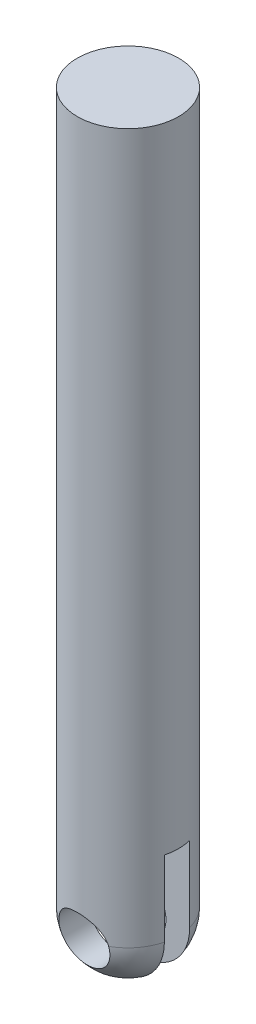
ISO-10303-21;
HEADER;
FILE_DESCRIPTION(('STEP AP214'),'2;1');
FILE_NAME('part.step','',(''),(''),'','','');
FILE_SCHEMA(('AUTOMOTIVE_DESIGN { 1 0 10303 214 1 1 1 1 }'));
ENDSEC;
DATA;
#1=APPLICATION_CONTEXT('core data for automotive mechanical design processes');
#2=APPLICATION_PROTOCOL_DEFINITION('international standard','automotive_design',2000,#1);
#3=PRODUCT_CONTEXT('',#1,'mechanical');
#4=PRODUCT('Part','Part','',(#3));
#5=PRODUCT_RELATED_PRODUCT_CATEGORY('part','',(#4));
#6=PRODUCT_DEFINITION_FORMATION('','',#4);
#7=PRODUCT_DEFINITION_CONTEXT('part definition',#1,'design');
#8=PRODUCT_DEFINITION('design','',#6,#7);
#9=PRODUCT_DEFINITION_SHAPE('','',#8);
#10=(LENGTH_UNIT() NAMED_UNIT(*) SI_UNIT(.MILLI.,.METRE.));
#11=(NAMED_UNIT(*) PLANE_ANGLE_UNIT() SI_UNIT($,.RADIAN.));
#12=(NAMED_UNIT(*) SI_UNIT($,.STERADIAN.) SOLID_ANGLE_UNIT());
#13=UNCERTAINTY_MEASURE_WITH_UNIT(LENGTH_MEASURE(1.E-05),#10,'distance_accuracy_value','');
#14=(GEOMETRIC_REPRESENTATION_CONTEXT(3) GLOBAL_UNCERTAINTY_ASSIGNED_CONTEXT((#13)) GLOBAL_UNIT_ASSIGNED_CONTEXT((#10,
#11,#12)) REPRESENTATION_CONTEXT('',''));
#15=CARTESIAN_POINT('',(0.,0.,0.));
#16=DIRECTION('',(0.,0.,1.));
#17=DIRECTION('',(1.,0.,0.));
#18=AXIS2_PLACEMENT_3D('',#15,#16,#17);
#19=CARTESIAN_POINT('',(0.,93.5,2.5));
#20=DIRECTION('',(0.,1.,0.));
#21=DIRECTION('',(1.,0.,0.));
#22=AXIS2_PLACEMENT_3D('',#19,#20,#21);
#23=SPHERICAL_SURFACE('',#22,10.);
#24=CARTESIAN_POINT('',(0.,93.5,2.5));
#25=DIRECTION('',(0.,1.,0.));
#26=DIRECTION('',(-1.,0.,0.));
#27=AXIS2_PLACEMENT_3D('',#24,#25,#26);
#28=CIRCLE('',#27,10.);
#29=CARTESIAN_POINT('',(4.89897948556635,93.5,11.2177978870813));
#30=VERTEX_POINT('',#29);
#31=CARTESIAN_POINT('',(9.68245836551854,93.5,5.));
#32=VERTEX_POINT('',#31);
#33=EDGE_CURVE('E111',#30,#32,#28,.T.);
#34=ORIENTED_EDGE('',*,*,#33,.F.);
#35=CARTESIAN_POINT('',(4.89893865648469,93.5002,11.2178208286245));
#36=CARTESIAN_POINT('',(4.92727418921963,93.3614873870076,11.2019098802133));
#37=CARTESIAN_POINT('',(4.94968515353325,93.2215887869732,11.1858184751447));
#38=CARTESIAN_POINT('',(4.98257086903547,92.9404311381345,11.1533879579725));
#39=CARTESIAN_POINT('',(4.99304624353029,92.799172160761,11.1370488588494));
#40=CARTESIAN_POINT('',(5.0019738665503,92.5163797265705,11.1042448150247));
#41=CARTESIAN_POINT('',(5.00043368842381,92.3748464988518,11.0877799561266));
#42=CARTESIAN_POINT('',(4.98536616484066,92.0924234657632,11.0548301095291));
#43=CARTESIAN_POINT('',(4.97183893845378,91.951533654016,11.0383451220313));
#44=CARTESIAN_POINT('',(4.93288594095179,91.6713588465171,11.0054681250731));
#45=CARTESIAN_POINT('',(4.90745701402313,91.5320742864509,10.9890761414407));
#46=CARTESIAN_POINT('',(4.84486426425658,91.256087182425,10.9565028063938));
#47=CARTESIAN_POINT('',(4.80769610914868,91.1193856114675,10.9403215350402));
#48=CARTESIAN_POINT('',(4.7219086944933,90.8496686132408,10.9083050231958));
#49=CARTESIAN_POINT('',(4.67329593200435,90.7166511422317,10.8924695919263));
#50=CARTESIAN_POINT('',(4.56492326752218,90.455123939594,10.8612494080196));
#51=CARTESIAN_POINT('',(4.50515926596108,90.3266158864868,10.8458648235431));
#52=CARTESIAN_POINT('',(4.37497965213287,90.0752178683008,10.8156877757602));
#53=CARTESIAN_POINT('',(4.3045755866293,89.9523219987986,10.8008946922911));
#54=CARTESIAN_POINT('',(4.1535285386618,89.7128420516729,10.7719945007179));
#55=CARTESIAN_POINT('',(4.07288177337091,89.5962603287924,10.757887648728));
#56=CARTESIAN_POINT('',(3.90195221061515,89.3703307733303,10.7304829323995));
#57=CARTESIAN_POINT('',(3.81167169322654,89.2609812389448,10.7171848778025));
#58=CARTESIAN_POINT('',(3.62205669025078,89.05024590475,10.6914990601853));
#59=CARTESIAN_POINT('',(3.52271888930685,88.9488630465753,10.6791116335154));
#60=CARTESIAN_POINT('',(3.3162831566464,88.7553812276067,10.6554216350037));
#61=CARTESIAN_POINT('',(3.2092303992527,88.6632347446997,10.6441135260503));
#62=CARTESIAN_POINT('',(2.98760357675197,88.4882463710375,10.6225986329848));
#63=CARTESIAN_POINT('',(2.8730267477674,88.405407930117,10.6123922572621));
#64=CARTESIAN_POINT('',(2.63725372669888,88.249724839181,10.5931787316651));
#65=CARTESIAN_POINT('',(2.5160606199192,88.17687558573,10.5841710294487));
#66=CARTESIAN_POINT('',(2.26782923052538,88.0416440206182,10.567425746954));
#67=CARTESIAN_POINT('',(2.14078881888704,87.979265560444,10.559688634061));
#68=CARTESIAN_POINT('',(1.88278611087447,87.8659080562942,10.5456115639289));
#69=CARTESIAN_POINT('',(1.75186082723434,87.8148462145952,10.5392614639566));
#70=CARTESIAN_POINT('',(1.48611564854605,87.7238902138853,10.5279394657527));
#71=CARTESIAN_POINT('',(1.35129434101507,87.6840001626356,10.5229680744658));
#72=CARTESIAN_POINT('',(0.942516399613429,87.5816316505213,10.5102021912795));
#73=CARTESIAN_POINT('',(0.6639590033556,87.5363290797153,10.5045403355134));
#74=CARTESIAN_POINT('',(0.10498784504106,87.4932786771967,10.4991602063714));
#75=CARTESIAN_POINT('',(-0.17540524566824,87.495251646546,10.4994070375818));
#76=CARTESIAN_POINT('',(-0.732041754387001,87.5460064676561,10.5057493957929));
#77=CARTESIAN_POINT('',(-1.00828524491241,87.5947875004583,10.5118448204661));
#78=CARTESIAN_POINT('',(-1.41305667331737,87.7017892741581,10.5251851478467));
#79=CARTESIAN_POINT('',(-1.54635769687637,87.7430841163154,10.5303301131128));
#80=CARTESIAN_POINT('',(-1.80898194746745,87.8366347892742,10.5419713905297));
#81=CARTESIAN_POINT('',(-1.93830660679206,87.8888866190365,10.5484672093975));
#82=CARTESIAN_POINT('',(-2.19211805644866,88.003995718812,10.5627564980459));
#83=CARTESIAN_POINT('',(-2.31660304688135,88.0668568889419,10.5705504450197));
#84=CARTESIAN_POINT('',(-2.55978589867423,88.2026888928239,10.587363502297));
#85=CARTESIAN_POINT('',(-2.67848582817454,88.2756560773338,10.5963821703358));
#86=CARTESIAN_POINT('',(-2.9097997684792,88.4315118110538,10.6156094270802));
#87=CARTESIAN_POINT('',(-3.02238652548756,88.5144402152202,10.6258227912078));
#88=CARTESIAN_POINT('',(-3.24012192540225,88.6893435291115,10.6473187303041));
#89=CARTESIAN_POINT('',(-3.34527322625725,88.7813151777597,10.6586009197916));
#90=CARTESIAN_POINT('',(-3.54749670634417,88.973705687764,10.6821482509802));
#91=CARTESIAN_POINT('',(-3.64456585328322,89.0741276913978,10.6944137582488));
#92=CARTESIAN_POINT('',(-3.82988426286666,89.2826354873295,10.7198194774713));
#93=CARTESIAN_POINT('',(-3.91813666956991,89.3907185240214,10.7329593748118));
#94=CARTESIAN_POINT('',(-4.08586673205085,89.6146229738032,10.7601108669664));
#95=CARTESIAN_POINT('',(-4.16527637864741,89.7304946575952,10.7741280742079));
#96=CARTESIAN_POINT('',(-4.31401014619419,89.9684016807158,10.8028313983562));
#97=CARTESIAN_POINT('',(-4.38333786544718,90.0904347999368,10.8175172741416));
#98=CARTESIAN_POINT('',(-4.51150563753912,90.3399088603274,10.8474572126065));
#99=CARTESIAN_POINT('',(-4.57033986925048,90.4673527548271,10.8627115850153));
#100=CARTESIAN_POINT('',(-4.67705487918588,90.7266401026458,10.8936594848664));
#101=CARTESIAN_POINT('',(-4.72493959993084,90.8584819527655,10.9093528519513));
#102=CARTESIAN_POINT('',(-4.80977031188505,91.1266701310123,10.9411844791957));
#103=CARTESIAN_POINT('',(-4.84663313374619,91.2630424848936,10.9573251648839));
#104=CARTESIAN_POINT('',(-4.90867764521969,91.5383416759631,10.9898143177904));
#105=CARTESIAN_POINT('',(-4.9338635602074,91.6772675701852,11.0061627076458));
#106=CARTESIAN_POINT('',(-4.97238944399948,91.9566609002362,11.0389455020962));
#107=CARTESIAN_POINT('',(-4.98573611283209,92.0971274185736,11.0553798527406));
#108=CARTESIAN_POINT('',(-5.00051338745893,92.3786389327653,11.0882214435698));
#109=CARTESIAN_POINT('',(-5.00194817252947,92.5196837083603,11.1046286912437));
#110=CARTESIAN_POINT('',(-4.99288785861755,92.8016459229522,11.1373351912218));
#111=CARTESIAN_POINT('',(-4.98237245056434,92.9425627366304,11.1536342121859));
#112=CARTESIAN_POINT('',(-4.94949463156491,93.2227767786761,11.1859551155558));
#113=CARTESIAN_POINT('',(-4.92715371833351,93.3620764787199,11.2019774465557));
#114=CARTESIAN_POINT('',(-4.89893865648469,93.5002,11.2178208286246));
#115=B_SPLINE_CURVE_WITH_KNOTS('',3,(#35,#36,#37,#38,#39,#40,#41,#42,#43,#44,#45,#46,#47,#48,
#49,#50,#51,#52,#53,#54,#55,#56,#57,#58,#59,#60,#61,#62,#63,#64,#65,#66,#67,#68,#69,#70,#71,#72,
#73,#74,#75,#76,#77,#78,#79,#80,#81,#82,#83,#84,#85,#86,#87,#88,#89,#90,#91,#92,#93,#94,#95,#96,
#97,#98,#99,#100,#101,#102,#103,#104,#105,#106,#107,#108,#109,#110,#111,#112,#113,#114),
.UNSPECIFIED.,.F.,.F.,(4,2,2,2,2,2,2,2,2,2,2,2,2,2,2,2,2,2,2,2,2,2,2,2,2,2,2,2,2,2,2,2,2,2,2,2,
2,2,2,4),(0.,0.427273695896813,0.854525077474799,1.28150718621249,1.70848505369805,
2.13557620134619,2.56282514815607,2.98983212981988,3.41699640392128,3.84370039795307,
4.27056244277984,4.69732368281735,5.12424176788651,5.54883647946182,5.97358804285703,
6.39814320033011,6.82285418194122,7.24434690288125,7.66599439982471,8.50836086019737,
9.34575372241116,10.1831319337798,10.6016659234076,11.0200473470292,11.4385829088634,
11.8569677312731,12.2770860649816,12.6970534519534,13.1171777004552,13.5371515933976,
13.9601599972521,14.3830170542763,14.8061079611405,15.2290462876217,15.6550998521153,
16.0809991254064,16.506657221096,16.932165968618,17.3583989410056,17.7838597076409),.UNSPECIFIED.);
#116=CARTESIAN_POINT('',(-4.89897948556635,93.5,11.2177978870814));
#117=VERTEX_POINT('',#116);
#118=EDGE_CURVE('E51',#30,#117,#115,.T.);
#119=ORIENTED_EDGE('',*,*,#118,.T.);
#120=CARTESIAN_POINT('',(-9.68245836551856,93.5,5.));
#121=VERTEX_POINT('',#120);
#122=EDGE_CURVE('E110',#121,#117,#28,.T.);
#123=ORIENTED_EDGE('',*,*,#122,.F.);
#124=CARTESIAN_POINT('',(0.,93.5,5.));
#125=DIRECTION('',(0.,0.,1.));
#126=DIRECTION('',(0.,-1.,0.));
#127=AXIS2_PLACEMENT_3D('',#124,#125,#126);
#128=CIRCLE('',#127,9.68245836551855);
#129=EDGE_CURVE('E125',#121,#32,#128,.T.);
#130=ORIENTED_EDGE('',*,*,#129,.T.);
#131=EDGE_LOOP('',(#34,#119,#123,#130));
#132=FACE_BOUND('',#131,.T.);
#133=ADVANCED_FACE('F36',(#132),#23,.T.);
#134=CARTESIAN_POINT('',(0.,233.5,2.5));
#135=DIRECTION('',(0.,-1.,0.));
#136=DIRECTION('',(1.,0.,0.));
#137=AXIS2_PLACEMENT_3D('',#134,#135,#136);
#138=PLANE('',#137);
#139=CARTESIAN_POINT('',(0.,233.5,2.5));
#140=DIRECTION('',(0.,1.,0.));
#141=DIRECTION('',(-1.,0.,0.));
#142=AXIS2_PLACEMENT_3D('',#139,#140,#141);
#143=CIRCLE('',#142,10.);
#144=CARTESIAN_POINT('',(-9.99999999999999,233.5,2.5));
#145=VERTEX_POINT('',#144);
#146=EDGE_CURVE('E116',#145,#145,#143,.T.);
#147=ORIENTED_EDGE('',*,*,#146,.T.);
#148=EDGE_LOOP('',(#147));
#149=FACE_BOUND('',#148,.T.);
#150=ADVANCED_FACE('F38',(#149),#138,.F.);
#151=CARTESIAN_POINT('',(0.,233.5,2.5));
#152=DIRECTION('',(0.,1.,0.));
#153=DIRECTION('',(-1.,0.,0.));
#154=AXIS2_PLACEMENT_3D('',#151,#152,#153);
#155=CYLINDRICAL_SURFACE('',#154,10.);
#156=ORIENTED_EDGE('',*,*,#146,.F.);
#157=EDGE_LOOP('',(#156));
#158=FACE_BOUND('',#157,.T.);
#159=ORIENTED_EDGE('',*,*,#122,.T.);
#160=CARTESIAN_POINT('',(-4.89897948556635,93.5,11.2177978870814));
#161=CARTESIAN_POINT('',(-4.87104349833318,93.6369384855685,11.233478375009));
#162=CARTESIAN_POINT('',(-4.83741488474298,93.7723099813617,11.2522179650321));
#163=CARTESIAN_POINT('',(-4.75930365987262,94.0389163103772,11.294946850961));
#164=CARTESIAN_POINT('',(-4.71483008370714,94.1701544848942,11.3189317751864));
#165=CARTESIAN_POINT('',(-4.61570987501826,94.4272090332767,11.3712074102433));
#166=CARTESIAN_POINT('',(-4.56110445618861,94.5530449155461,11.3994805953781));
#167=CARTESIAN_POINT('',(-4.44213756616435,94.7991537347802,11.4594564697463));
#168=CARTESIAN_POINT('',(-4.37777409514467,94.9194255248247,11.4911598615877));
#169=CARTESIAN_POINT('',(-4.17123049744626,95.2702483854698,11.5897764896488));
#170=CARTESIAN_POINT('',(-4.01521589862719,95.4917850876563,11.6604075821168));
#171=CARTESIAN_POINT('',(-3.66982029663845,95.90666932499,11.8041589851695));
#172=CARTESIAN_POINT('',(-3.48039309764252,96.0999771459841,11.8772826275132));
#173=CARTESIAN_POINT('',(-3.1668573317209,96.371952846699,11.9860152543039));
#174=CARTESIAN_POINT('',(-3.05319684918641,96.4622110724451,12.0232952243291));
#175=CARTESIAN_POINT('',(-2.81798349877699,96.6328022897707,12.0955238119123));
#176=CARTESIAN_POINT('',(-2.69643360210925,96.7131389851578,12.1304732972087));
#177=CARTESIAN_POINT('',(-2.44611729460878,96.8632338074191,12.1970762184314));
#178=CARTESIAN_POINT('',(-2.31735114221229,96.9329923127995,12.2287297722794));
#179=CARTESIAN_POINT('',(-2.05346425440719,97.0612265404892,12.2878266038412));
#180=CARTESIAN_POINT('',(-1.91834692859288,97.1197082325667,12.3152721076456));
#181=CARTESIAN_POINT('',(-1.64834218796651,97.2226022756219,12.3641273235605));
#182=CARTESIAN_POINT('',(-1.51367453360394,97.2674949118097,12.3857390813795));
#183=CARTESIAN_POINT('',(-1.24038064451454,97.3457865302565,12.4237328975984));
#184=CARTESIAN_POINT('',(-1.10175638416906,97.3791911401861,12.4401175163456));
#185=CARTESIAN_POINT('',(-0.821669991821929,97.4340871595084,12.4671784080935));
#186=CARTESIAN_POINT('',(-0.680208939144742,97.4555830139871,12.477856810955));
#187=CARTESIAN_POINT('',(-0.395645237857533,97.4863754344659,12.4931856703762));
#188=CARTESIAN_POINT('',(-0.252542739820538,97.4956731105428,12.4978366754498));
#189=CARTESIAN_POINT('',(0.0198623327122231,97.501629428405,12.5008147075909));
#190=CARTESIAN_POINT('',(0.149134996902007,97.4994433970262,12.4997198166663));
#191=CARTESIAN_POINT('',(0.407029112407416,97.485078698897,12.4925457248736));
#192=CARTESIAN_POINT('',(0.53565034038626,97.4728968114429,12.4864649175242));
#193=CARTESIAN_POINT('',(0.791193089472857,97.4386866400429,12.4694737103009));
#194=CARTESIAN_POINT('',(0.918115312043412,97.4166625573939,12.4585653711544));
#195=CARTESIAN_POINT('',(1.16947473087862,97.3630085933616,12.4321854396539));
#196=CARTESIAN_POINT('',(1.29391095727814,97.3313750381117,12.4167121020878));
#197=CARTESIAN_POINT('',(1.53753539714847,97.2593973812568,12.3818463148536));
#198=CARTESIAN_POINT('',(1.65677509365263,97.2191961350442,12.3625184387188));
#199=CARTESIAN_POINT('',(1.89134748177165,97.1301795768773,12.3202360994228));
#200=CARTESIAN_POINT('',(2.0066787936292,97.0813612598762,12.2972803714074));
#201=CARTESIAN_POINT('',(2.34581151922415,96.9225992827286,12.223709476578));
#202=CARTESIAN_POINT('',(2.56294019078022,96.8002923162603,12.1683624610283));
#203=CARTESIAN_POINT('',(2.99198662061079,96.5149474307137,12.0447349812844));
#204=CARTESIAN_POINT('',(3.20201952118904,96.3493931870709,11.9757663556231));
#205=CARTESIAN_POINT('',(3.59278517505727,95.9875427810784,11.8346198515953));
#206=CARTESIAN_POINT('',(3.77348259834384,95.7912101018571,11.7624382349858));
#207=CARTESIAN_POINT('',(4.11617962811637,95.3531962199911,11.6156320605665));
#208=CARTESIAN_POINT('',(4.27523725244417,95.1090676955732,11.5413307706622));
#209=CARTESIAN_POINT('',(4.48085164409501,94.7233339511661,11.4402354482765));
#210=CARTESIAN_POINT('',(4.54386186974605,94.591598139032,11.4082818422301));
#211=CARTESIAN_POINT('',(4.65840023005525,94.3222710852403,11.3489243641956));
#212=CARTESIAN_POINT('',(4.70993625679031,94.1846839462483,11.3215173683282));
#213=CARTESIAN_POINT('',(4.78433735318512,93.9556397368281,11.281298303135));
#214=CARTESIAN_POINT('',(4.81080902394751,93.8656290629946,11.2668057909693));
#215=CARTESIAN_POINT('',(4.85870427077353,93.6839812295806,11.2403502507724));
#216=CARTESIAN_POINT('',(4.88013147156932,93.5923452890728,11.2283854071093));
#217=CARTESIAN_POINT('',(4.89897948556635,93.5,11.2177978870813));
#218=B_SPLINE_CURVE_WITH_KNOTS('',3,(#160,#161,#162,#163,#164,#165,#166,#167,#168,#169,#170,
#171,#172,#173,#174,#175,#176,#177,#178,#179,#180,#181,#182,#183,#184,#185,#186,#187,#188,#189,
#190,#191,#192,#193,#194,#195,#196,#197,#198,#199,#200,#201,#202,#203,#204,#205,#206,#207,#208,
#209,#210,#211,#212,#213,#214,#215,#216,#217),.UNSPECIFIED.,.F.,.F.,(4,2,2,2,2,2,2,2,2,2,2,2,2,
2,2,2,2,2,2,2,2,2,2,2,2,2,2,2,4),(0.,0.421672305953377,0.842994502922417,1.26263901908108,
1.68236965415838,2.51865705181693,3.35610988446723,3.80518928425794,4.25410052813424,
4.70299570538355,5.151652588191,5.58182977746259,6.01179593349062,6.44160149116709,
6.87136793232118,7.258778902637,7.64631474731075,8.03368532395691,8.42120418582105,
8.8027068308287,9.18434278175017,9.94702519497318,10.7722025163055,11.5983663784935,
12.4955393601446,12.9434998164928,13.3911512024052,13.6757912642916,13.9602261679081),.UNSPECIFIED.);
#219=EDGE_CURVE('E98',#117,#30,#218,.T.);
#220=ORIENTED_EDGE('',*,*,#219,.T.);
#221=ORIENTED_EDGE('',*,*,#33,.T.);
#222=DIRECTION('',(0.,1.,0.));
#223=VECTOR('',#222,1.);
#224=CARTESIAN_POINT('',(9.68245836551855,233.5,5.00000000000002));
#225=LINE('',#224,#223);
#226=CARTESIAN_POINT('',(9.68245836551854,108.400596071662,5.));
#227=VERTEX_POINT('',#226);
#228=EDGE_CURVE('E108',#32,#227,#225,.T.);
#229=ORIENTED_EDGE('',*,*,#228,.T.);
#230=CARTESIAN_POINT('',(0.,108.400596071662,2.5));
#231=DIRECTION('',(0.,1.,0.));
#232=DIRECTION('',(0.,0.,1.));
#233=AXIS2_PLACEMENT_3D('',#230,#231,#232);
#234=CIRCLE('',#233,10.);
#235=CARTESIAN_POINT('',(9.68245836551853,108.400596071662,0.));
#236=VERTEX_POINT('',#235);
#237=EDGE_CURVE('E45',#227,#236,#234,.T.);
#238=ORIENTED_EDGE('',*,*,#237,.T.);
#239=DIRECTION('',(0.,1.,0.));
#240=VECTOR('',#239,1.);
#241=CARTESIAN_POINT('',(9.68245836551855,233.5,0.));
#242=LINE('',#241,#240);
#243=CARTESIAN_POINT('',(9.68245836551854,93.5,0.));
#244=VERTEX_POINT('',#243);
#245=EDGE_CURVE('E197',#236,#244,#242,.F.);
#246=ORIENTED_EDGE('',*,*,#245,.T.);
#247=CARTESIAN_POINT('',(4.89897948556635,93.5,-6.21779788708135));
#248=VERTEX_POINT('',#247);
#249=EDGE_CURVE('E97',#244,#248,#28,.T.);
#250=ORIENTED_EDGE('',*,*,#249,.T.);
#251=CARTESIAN_POINT('',(4.89897948556635,93.5,-6.21779788708134));
#252=CARTESIAN_POINT('',(4.87104349833318,93.6369384855685,-6.233478375009));
#253=CARTESIAN_POINT('',(4.83741488474298,93.7723099813617,-6.25221796503205));
#254=CARTESIAN_POINT('',(4.75930365987262,94.0389163103772,-6.29494685096101));
#255=CARTESIAN_POINT('',(4.71483008370714,94.1701544848942,-6.31893177518635));
#256=CARTESIAN_POINT('',(4.61570987501826,94.4272090332767,-6.37120741024334));
#257=CARTESIAN_POINT('',(4.56110445618861,94.5530449155461,-6.39948059537804));
#258=CARTESIAN_POINT('',(4.44213756616435,94.7991537347802,-6.45945646974632));
#259=CARTESIAN_POINT('',(4.37777409514467,94.9194255248247,-6.49115986158769));
#260=CARTESIAN_POINT('',(4.17123049744626,95.2702483854698,-6.58977648964884));
#261=CARTESIAN_POINT('',(4.01521589862719,95.4917850876563,-6.66040758211675));
#262=CARTESIAN_POINT('',(3.66982029663845,95.90666932499,-6.80415898516953));
#263=CARTESIAN_POINT('',(3.48039309764252,96.0999771459841,-6.87728262751317));
#264=CARTESIAN_POINT('',(3.1668573317209,96.371952846699,-6.9860152543039));
#265=CARTESIAN_POINT('',(3.05319684918641,96.4622110724451,-7.02329522432906));
#266=CARTESIAN_POINT('',(2.817983498777,96.6328022897707,-7.09552381191233));
#267=CARTESIAN_POINT('',(2.69643360210925,96.7131389851578,-7.13047329720867));
#268=CARTESIAN_POINT('',(2.44611729460878,96.8632338074191,-7.19707621843141));
#269=CARTESIAN_POINT('',(2.31735114221229,96.9329923127995,-7.22872977227934));
#270=CARTESIAN_POINT('',(2.05346425440718,97.0612265404892,-7.28782660384117));
#271=CARTESIAN_POINT('',(1.91834692859288,97.1197082325667,-7.31527210764558));
#272=CARTESIAN_POINT('',(1.64834218796651,97.2226022756219,-7.3641273235605));
#273=CARTESIAN_POINT('',(1.51367453360394,97.2674949118096,-7.38573908137951));
#274=CARTESIAN_POINT('',(1.24038064451455,97.3457865302565,-7.42373289759839));
#275=CARTESIAN_POINT('',(1.10175638416906,97.3791911401861,-7.4401175163456));
#276=CARTESIAN_POINT('',(0.821669991821929,97.4340871595084,-7.4671784080935));
#277=CARTESIAN_POINT('',(0.680208939144741,97.4555830139871,-7.477856810955));
#278=CARTESIAN_POINT('',(0.395645237857532,97.4863754344659,-7.49318567037625));
#279=CARTESIAN_POINT('',(0.252542739820537,97.4956731105428,-7.4978366754498));
#280=CARTESIAN_POINT('',(-0.0198623327122239,97.501629428405,-7.50081470759086));
#281=CARTESIAN_POINT('',(-0.149134996902008,97.4994433970262,-7.4997198166663));
#282=CARTESIAN_POINT('',(-0.407029112407417,97.485078698897,-7.49254572487357));
#283=CARTESIAN_POINT('',(-0.535650340386261,97.4728968114429,-7.48646491752423));
#284=CARTESIAN_POINT('',(-0.791193089472856,97.4386866400429,-7.46947371030086));
#285=CARTESIAN_POINT('',(-0.91811531204341,97.4166625573939,-7.45856537115443));
#286=CARTESIAN_POINT('',(-1.16947473087862,97.3630085933616,-7.43218543965391));
#287=CARTESIAN_POINT('',(-1.29391095727814,97.3313750381117,-7.41671210208776));
#288=CARTESIAN_POINT('',(-1.53753539714847,97.2593973812568,-7.38184631485359));
#289=CARTESIAN_POINT('',(-1.65677509365263,97.2191961350442,-7.36251843871884));
#290=CARTESIAN_POINT('',(-1.89134748177165,97.1301795768773,-7.32023609942282));
#291=CARTESIAN_POINT('',(-2.0066787936292,97.0813612598762,-7.29728037140741));
#292=CARTESIAN_POINT('',(-2.34581151922415,96.9225992827286,-7.22370947657796));
#293=CARTESIAN_POINT('',(-2.56294019078023,96.8002923162603,-7.16836246102831));
#294=CARTESIAN_POINT('',(-2.99198662061079,96.5149474307137,-7.04473498128436));
#295=CARTESIAN_POINT('',(-3.20201952118904,96.3493931870709,-6.9757663556231));
#296=CARTESIAN_POINT('',(-3.59278517505727,95.9875427810784,-6.83461985159527));
#297=CARTESIAN_POINT('',(-3.77348259834384,95.7912101018571,-6.76243823498584));
#298=CARTESIAN_POINT('',(-4.11617962811637,95.3531962199911,-6.61563206056646));
#299=CARTESIAN_POINT('',(-4.27523725244417,95.1090676955732,-6.54133077066218));
#300=CARTESIAN_POINT('',(-4.48085164409501,94.7233339511661,-6.44023544827651));
#301=CARTESIAN_POINT('',(-4.54386186974605,94.591598139032,-6.40828184223013));
#302=CARTESIAN_POINT('',(-4.65840023005525,94.3222710852403,-6.34892436419565));
#303=CARTESIAN_POINT('',(-4.70993625679031,94.1846839462483,-6.32151736832826));
#304=CARTESIAN_POINT('',(-4.78433735318512,93.9556397368281,-6.28129830313504));
#305=CARTESIAN_POINT('',(-4.81080902394751,93.8656290629946,-6.26680579096934));
#306=CARTESIAN_POINT('',(-4.85870427077353,93.6839812295806,-6.24035025077242));
#307=CARTESIAN_POINT('',(-4.88013147156932,93.5923452890728,-6.22838540710932));
#308=CARTESIAN_POINT('',(-4.89897948556635,93.5,-6.21779788708136));
#309=B_SPLINE_CURVE_WITH_KNOTS('',3,(#251,#252,#253,#254,#255,#256,#257,#258,#259,#260,#261,
#262,#263,#264,#265,#266,#267,#268,#269,#270,#271,#272,#273,#274,#275,#276,#277,#278,#279,#280,
#281,#282,#283,#284,#285,#286,#287,#288,#289,#290,#291,#292,#293,#294,#295,#296,#297,#298,#299,
#300,#301,#302,#303,#304,#305,#306,#307,#308),.UNSPECIFIED.,.F.,.F.,(4,2,2,2,2,2,2,2,2,2,2,2,2,
2,2,2,2,2,2,2,2,2,2,2,2,2,2,2,4),(0.,0.421672305953377,0.842994502922418,1.26263901908107,
1.68236965415838,2.51865705181694,3.35610988446723,3.80518928425794,4.25410052813424,
4.70299570538356,5.151652588191,5.58182977746258,6.01179593349062,6.44160149116709,
6.87136793232118,7.258778902637,7.64631474731075,8.0336853239569,8.42120418582105,
8.8027068308287,9.18434278175017,9.94702519497318,10.7722025163055,11.5983663784935,
12.4955393601446,12.9434998164928,13.3911512024052,13.6757912642916,13.9602261679081),.UNSPECIFIED.);
#310=CARTESIAN_POINT('',(-4.89897948556635,93.5,-6.21779788708136));
#311=VERTEX_POINT('',#310);
#312=EDGE_CURVE('E58',#248,#311,#309,.T.);
#313=ORIENTED_EDGE('',*,*,#312,.T.);
#314=CARTESIAN_POINT('',(-9.68245836551856,93.5,0.));
#315=VERTEX_POINT('',#314);
#316=EDGE_CURVE('E93',#311,#315,#28,.T.);
#317=ORIENTED_EDGE('',*,*,#316,.T.);
#318=DIRECTION('',(0.,1.,0.));
#319=VECTOR('',#318,1.);
#320=CARTESIAN_POINT('',(-9.68245836551854,233.5,0.));
#321=LINE('',#320,#319);
#322=CARTESIAN_POINT('',(-9.68245836551855,108.400596071662,0.));
#323=VERTEX_POINT('',#322);
#324=EDGE_CURVE('E199',#315,#323,#321,.T.);
#325=ORIENTED_EDGE('',*,*,#324,.T.);
#326=CARTESIAN_POINT('',(-9.68245836551855,108.400596071662,5.));
#327=VERTEX_POINT('',#326);
#328=EDGE_CURVE('E11',#323,#327,#234,.T.);
#329=ORIENTED_EDGE('',*,*,#328,.T.);
#330=DIRECTION('',(0.,1.,0.));
#331=VECTOR('',#330,1.);
#332=CARTESIAN_POINT('',(-9.68245836551853,233.5,5.00000000000002));
#333=LINE('',#332,#331);
#334=EDGE_CURVE('E113',#327,#121,#333,.F.);
#335=ORIENTED_EDGE('',*,*,#334,.T.);
#336=EDGE_LOOP('',(#159,#220,#221,#229,#238,#246,#250,#313,#317,#325,#329,#335));
#337=FACE_BOUND('',#336,.T.);
#338=ADVANCED_FACE('F90',(#158,#337),#155,.T.);
#339=ORIENTED_EDGE('',*,*,#316,.F.);
#340=CARTESIAN_POINT('',(-4.89893865648469,93.5002,-6.21782082862456));
#341=CARTESIAN_POINT('',(-4.92727418921963,93.3614873870076,-6.20190988021332));
#342=CARTESIAN_POINT('',(-4.94968515353325,93.2215887869732,-6.18581847514466));
#343=CARTESIAN_POINT('',(-4.98257086903547,92.9404311381345,-6.15338795797251));
#344=CARTESIAN_POINT('',(-4.99304624353029,92.799172160761,-6.13704885884937));
#345=CARTESIAN_POINT('',(-5.0019738665503,92.5163797265705,-6.10424481502466));
#346=CARTESIAN_POINT('',(-5.00043368842381,92.3748464988518,-6.08777995612661));
#347=CARTESIAN_POINT('',(-4.98536616484066,92.0924234657632,-6.05483010952916));
#348=CARTESIAN_POINT('',(-4.97183893845378,91.951533654016,-6.03834512203133));
#349=CARTESIAN_POINT('',(-4.93288594095179,91.6713588465171,-6.00546812507309));
#350=CARTESIAN_POINT('',(-4.90745701402313,91.5320742864509,-5.98907614144073));
#351=CARTESIAN_POINT('',(-4.84486426425658,91.256087182425,-5.95650280639385));
#352=CARTESIAN_POINT('',(-4.80769610914868,91.1193856114675,-5.94032153504018));
#353=CARTESIAN_POINT('',(-4.7219086944933,90.8496686132408,-5.90830502319584));
#354=CARTESIAN_POINT('',(-4.67329593200435,90.7166511422317,-5.89246959192635));
#355=CARTESIAN_POINT('',(-4.56492326752218,90.455123939594,-5.86124940801957));
#356=CARTESIAN_POINT('',(-4.50515926596108,90.3266158864868,-5.8458648235431));
#357=CARTESIAN_POINT('',(-4.37497965213287,90.0752178683008,-5.81568777576026));
#358=CARTESIAN_POINT('',(-4.30457558662928,89.9523219987986,-5.80089469229109));
#359=CARTESIAN_POINT('',(-4.15352853866178,89.7128420516729,-5.77199450071786));
#360=CARTESIAN_POINT('',(-4.0728817733709,89.5962603287923,-5.75788764872803));
#361=CARTESIAN_POINT('',(-3.90195221061514,89.3703307733303,-5.73048293239947));
#362=CARTESIAN_POINT('',(-3.81167169322653,89.2609812389448,-5.71718487780253));
#363=CARTESIAN_POINT('',(-3.62205669025077,89.05024590475,-5.69149906018535));
#364=CARTESIAN_POINT('',(-3.52271888930684,88.9488630465753,-5.67911163351542));
#365=CARTESIAN_POINT('',(-3.31628315664639,88.7553812276067,-5.65542163500371));
#366=CARTESIAN_POINT('',(-3.20923039925269,88.6632347446997,-5.64411352605036));
#367=CARTESIAN_POINT('',(-2.98760357675197,88.4882463710375,-5.6225986329848));
#368=CARTESIAN_POINT('',(-2.87302674776739,88.405407930117,-5.61239225726212));
#369=CARTESIAN_POINT('',(-2.63725372669888,88.249724839181,-5.59317873166508));
#370=CARTESIAN_POINT('',(-2.5160606199192,88.17687558573,-5.58417102944869));
#371=CARTESIAN_POINT('',(-2.26782923052538,88.0416440206182,-5.56742574695401));
#372=CARTESIAN_POINT('',(-2.14078881888704,87.979265560444,-5.55968863406098));
#373=CARTESIAN_POINT('',(-1.88278611087447,87.8659080562942,-5.54561156392891));
#374=CARTESIAN_POINT('',(-1.75186082723434,87.8148462145952,-5.53926146395657));
#375=CARTESIAN_POINT('',(-1.48611564854605,87.7238902138853,-5.52793946575273));
#376=CARTESIAN_POINT('',(-1.35129434101507,87.6840001626356,-5.52296807446585));
#377=CARTESIAN_POINT('',(-0.942516399613429,87.5816316505213,-5.51020219127945));
#378=CARTESIAN_POINT('',(-0.6639590033556,87.5363290797153,-5.50454033551344));
#379=CARTESIAN_POINT('',(-0.104987845041059,87.4932786771967,-5.49916020637143));
#380=CARTESIAN_POINT('',(0.17540524566824,87.495251646546,-5.49940703758177));
#381=CARTESIAN_POINT('',(0.732041754387,87.5460064676561,-5.50574939579288));
#382=CARTESIAN_POINT('',(1.00828524491241,87.5947875004583,-5.51184482046606));
#383=CARTESIAN_POINT('',(1.41305667331737,87.7017892741581,-5.52518514784674));
#384=CARTESIAN_POINT('',(1.54635769687637,87.7430841163154,-5.53033011311284));
#385=CARTESIAN_POINT('',(1.80898194746745,87.8366347892742,-5.54197139052974));
#386=CARTESIAN_POINT('',(1.93830660679206,87.8888866190365,-5.54846720939748));
#387=CARTESIAN_POINT('',(2.19211805644866,88.003995718812,-5.56275649804591));
#388=CARTESIAN_POINT('',(2.31660304688135,88.0668568889419,-5.57055044501966));
#389=CARTESIAN_POINT('',(2.55978589867423,88.2026888928239,-5.58736350229702));
#390=CARTESIAN_POINT('',(2.67848582817454,88.2756560773338,-5.59638217033582));
#391=CARTESIAN_POINT('',(2.9097997684792,88.4315118110538,-5.61560942708021));
#392=CARTESIAN_POINT('',(3.02238652548756,88.5144402152202,-5.62582279120775));
#393=CARTESIAN_POINT('',(3.24012192540225,88.6893435291115,-5.64731873030414));
#394=CARTESIAN_POINT('',(3.34527322625725,88.7813151777597,-5.65860091979158));
#395=CARTESIAN_POINT('',(3.54749670634417,88.973705687764,-5.68214825098024));
#396=CARTESIAN_POINT('',(3.64456585328322,89.0741276913978,-5.69441375824883));
#397=CARTESIAN_POINT('',(3.82988426286666,89.2826354873295,-5.71981947747132));
#398=CARTESIAN_POINT('',(3.91813666956991,89.3907185240214,-5.73295937481182));
#399=CARTESIAN_POINT('',(4.08586673205085,89.6146229738032,-5.76011086696643));
#400=CARTESIAN_POINT('',(4.16527637864741,89.7304946575952,-5.77412807420788));
#401=CARTESIAN_POINT('',(4.31401014619419,89.9684016807158,-5.80283139835615));
#402=CARTESIAN_POINT('',(4.38333786544718,90.0904347999368,-5.81751727414155));
#403=CARTESIAN_POINT('',(4.51150563753912,90.3399088603274,-5.8474572126065));
#404=CARTESIAN_POINT('',(4.57033986925048,90.4673527548271,-5.86271158501524));
#405=CARTESIAN_POINT('',(4.67705487918588,90.7266401026458,-5.89365948486643));
#406=CARTESIAN_POINT('',(4.72493959993084,90.8584819527655,-5.90935285195132));
#407=CARTESIAN_POINT('',(4.80977031188504,91.1266701310123,-5.94118447919564));
#408=CARTESIAN_POINT('',(4.84663313374619,91.2630424848936,-5.95732516488393));
#409=CARTESIAN_POINT('',(4.90867764521969,91.5383416759631,-5.98981431779043));
#410=CARTESIAN_POINT('',(4.93386356020739,91.6772675701852,-6.00616270764579));
#411=CARTESIAN_POINT('',(4.97238944399948,91.9566609002362,-6.03894550209624));
#412=CARTESIAN_POINT('',(4.98573611283209,92.0971274185736,-6.05537985274058));
#413=CARTESIAN_POINT('',(5.00051338745893,92.3786389327653,-6.08822144356982));
#414=CARTESIAN_POINT('',(5.00194817252947,92.5196837083603,-6.10462869124365));
#415=CARTESIAN_POINT('',(4.99288785861755,92.8016459229522,-6.13733519122176));
#416=CARTESIAN_POINT('',(4.98237245056434,92.9425627366304,-6.15363421218588));
#417=CARTESIAN_POINT('',(4.94949463156491,93.2227767786761,-6.18595511555578));
#418=CARTESIAN_POINT('',(4.92715371833351,93.3620764787199,-6.20197744655565));
#419=CARTESIAN_POINT('',(4.89893865648469,93.5002,-6.21782082862455));
#420=B_SPLINE_CURVE_WITH_KNOTS('',3,(#340,#341,#342,#343,#344,#345,#346,#347,#348,#349,#350,
#351,#352,#353,#354,#355,#356,#357,#358,#359,#360,#361,#362,#363,#364,#365,#366,#367,#368,#369,
#370,#371,#372,#373,#374,#375,#376,#377,#378,#379,#380,#381,#382,#383,#384,#385,#386,#387,#388,
#389,#390,#391,#392,#393,#394,#395,#396,#397,#398,#399,#400,#401,#402,#403,#404,#405,#406,#407,
#408,#409,#410,#411,#412,#413,#414,#415,#416,#417,#418,#419),.UNSPECIFIED.,.F.,.F.,(4,2,2,2,2,2,
2,2,2,2,2,2,2,2,2,2,2,2,2,2,2,2,2,2,2,2,2,2,2,2,2,2,2,2,2,2,2,2,2,4),(0.,0.427273695896812,
0.854525077474799,1.28150718621249,1.70848505369805,2.13557620134619,2.56282514815606,
2.98983212981988,3.41699640392129,3.8437003979531,4.27056244277985,4.69732368281736,
5.12424176788651,5.54883647946183,5.97358804285703,6.39814320033011,6.82285418194122,
7.24434690288125,7.66599439982471,8.50836086019737,9.34575372241116,10.1831319337798,
10.6016659234076,11.0200473470292,11.4385829088634,11.8569677312731,12.2770860649816,
12.6970534519533,13.1171777004552,13.5371515933976,13.9601599972521,14.3830170542763,
14.8061079611405,15.2290462876217,15.6550998521153,16.0809991254064,16.506657221096,
16.932165968618,17.3583989410056,17.7838597076409),.UNSPECIFIED.);
#421=EDGE_CURVE('E99',#311,#248,#420,.T.);
#422=ORIENTED_EDGE('',*,*,#421,.T.);
#423=ORIENTED_EDGE('',*,*,#249,.F.);
#424=CARTESIAN_POINT('',(0.,93.5,0.));
#425=DIRECTION('',(0.,0.,-1.));
#426=DIRECTION('',(-1.,0.,0.));
#427=AXIS2_PLACEMENT_3D('',#424,#425,#426);
#428=CIRCLE('',#427,9.68245836551855);
#429=EDGE_CURVE('E107',#244,#315,#428,.T.);
#430=ORIENTED_EDGE('',*,*,#429,.T.);
#431=EDGE_LOOP('',(#339,#422,#423,#430));
#432=FACE_BOUND('',#431,.T.);
#433=ADVANCED_FACE('F106',(#432),#23,.T.);
#434=CARTESIAN_POINT('',(-10.,108.400596071662,5.));
#435=DIRECTION('',(0.,1.,0.));
#436=DIRECTION('',(0.,0.,1.));
#437=AXIS2_PLACEMENT_3D('',#434,#435,#436);
#438=PLANE('',#437);
#439=DIRECTION('',(1.,0.,0.));
#440=VECTOR('',#439,1.);
#441=CARTESIAN_POINT('',(-10.,108.400596071662,5.));
#442=LINE('',#441,#440);
#443=EDGE_CURVE('E128',#327,#227,#442,.T.);
#444=ORIENTED_EDGE('',*,*,#443,.F.);
#445=ORIENTED_EDGE('',*,*,#328,.F.);
#446=DIRECTION('',(1.,0.,0.));
#447=VECTOR('',#446,1.);
#448=CARTESIAN_POINT('',(-10.,108.400596071662,0.));
#449=LINE('',#448,#447);
#450=EDGE_CURVE('E164',#323,#236,#449,.T.);
#451=ORIENTED_EDGE('',*,*,#450,.T.);
#452=ORIENTED_EDGE('',*,*,#237,.F.);
#453=EDGE_LOOP('',(#444,#445,#451,#452));
#454=FACE_BOUND('',#453,.T.);
#455=ADVANCED_FACE('F141',(#454),#438,.F.);
#456=CARTESIAN_POINT('',(-10.,108.400596071662,5.));
#457=DIRECTION('',(0.,0.,1.));
#458=DIRECTION('',(0.,-1.,0.));
#459=AXIS2_PLACEMENT_3D('',#456,#457,#458);
#460=PLANE('',#459);
#461=CARTESIAN_POINT('',(0.,92.5,5.));
#462=DIRECTION('',(0.,0.,1.));
#463=DIRECTION('',(0.,-1.,0.));
#464=AXIS2_PLACEMENT_3D('',#461,#462,#463);
#465=CIRCLE('',#464,5.);
#466=CARTESIAN_POINT('',(0.,87.5,5.));
#467=VERTEX_POINT('',#466);
#468=EDGE_CURVE('E103',#467,#467,#465,.T.);
#469=ORIENTED_EDGE('',*,*,#468,.T.);
#470=EDGE_LOOP('',(#469));
#471=FACE_BOUND('',#470,.T.);
#472=ORIENTED_EDGE('',*,*,#129,.F.);
#473=ORIENTED_EDGE('',*,*,#334,.F.);
#474=ORIENTED_EDGE('',*,*,#443,.T.);
#475=ORIENTED_EDGE('',*,*,#228,.F.);
#476=EDGE_LOOP('',(#472,#473,#474,#475));
#477=FACE_BOUND('',#476,.T.);
#478=ADVANCED_FACE('F124',(#471,#477),#460,.F.);
#479=CARTESIAN_POINT('',(-10.,108.400596071662,0.));
#480=DIRECTION('',(0.,0.,-1.));
#481=DIRECTION('',(-1.,0.,0.));
#482=AXIS2_PLACEMENT_3D('',#479,#480,#481);
#483=PLANE('',#482);
#484=CARTESIAN_POINT('',(0.,92.5,0.));
#485=DIRECTION('',(0.,0.,-1.));
#486=DIRECTION('',(-1.,0.,0.));
#487=AXIS2_PLACEMENT_3D('',#484,#485,#486);
#488=CIRCLE('',#487,5.);
#489=CARTESIAN_POINT('',(-5.,92.5,0.));
#490=VERTEX_POINT('',#489);
#491=EDGE_CURVE('E40',#490,#490,#488,.T.);
#492=ORIENTED_EDGE('',*,*,#491,.T.);
#493=EDGE_LOOP('',(#492));
#494=FACE_BOUND('',#493,.T.);
#495=ORIENTED_EDGE('',*,*,#429,.F.);
#496=ORIENTED_EDGE('',*,*,#245,.F.);
#497=ORIENTED_EDGE('',*,*,#450,.F.);
#498=ORIENTED_EDGE('',*,*,#324,.F.);
#499=EDGE_LOOP('',(#495,#496,#497,#498));
#500=FACE_BOUND('',#499,.T.);
#501=ADVANCED_FACE('F184',(#494,#500),#483,.F.);
#502=CARTESIAN_POINT('',(0.,92.5,-7.5));
#503=DIRECTION('',(0.,0.,1.));
#504=DIRECTION('',(1.,0.,0.));
#505=AXIS2_PLACEMENT_3D('',#502,#503,#504);
#506=CYLINDRICAL_SURFACE('',#505,5.);
#507=ORIENTED_EDGE('',*,*,#491,.F.);
#508=EDGE_LOOP('',(#507));
#509=FACE_BOUND('',#508,.T.);
#510=ORIENTED_EDGE('',*,*,#421,.F.);
#511=ORIENTED_EDGE('',*,*,#312,.F.);
#512=EDGE_LOOP('',(#510,#511));
#513=FACE_BOUND('',#512,.T.);
#514=ADVANCED_FACE('F101',(#509,#513),#506,.F.);
#515=ORIENTED_EDGE('',*,*,#468,.F.);
#516=EDGE_LOOP('',(#515));
#517=FACE_BOUND('',#516,.T.);
#518=ORIENTED_EDGE('',*,*,#219,.F.);
#519=ORIENTED_EDGE('',*,*,#118,.F.);
#520=EDGE_LOOP('',(#518,#519));
#521=FACE_BOUND('',#520,.T.);
#522=ADVANCED_FACE('F170',(#517,#521),#506,.F.);
#523=CLOSED_SHELL('',(#133,#150,#338,#433,#455,#478,#501,#514,#522));
#524=MANIFOLD_SOLID_BREP('B2',#523);
#525=ADVANCED_BREP_SHAPE_REPRESENTATION('',(#18,#524),#14);
#526=SHAPE_DEFINITION_REPRESENTATION(#9,#525);
ENDSEC;
END-ISO-10303-21;
